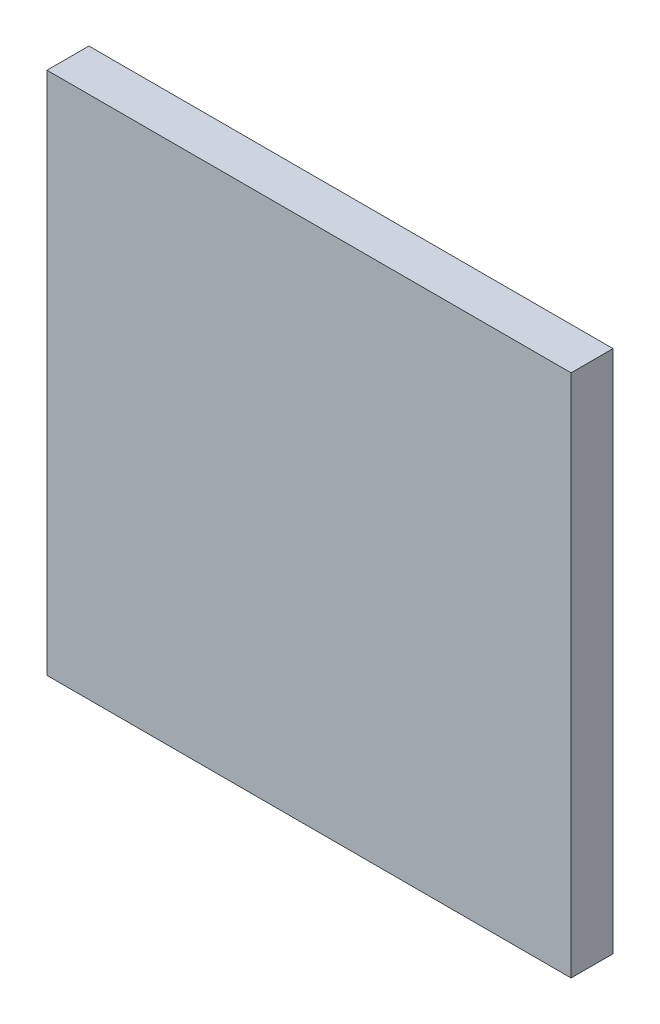
ISO-10303-21;
HEADER;
FILE_DESCRIPTION(('STEP AP214'),'2;1');
FILE_NAME('part.step','',(''),(''),'','','');
FILE_SCHEMA(('AUTOMOTIVE_DESIGN { 1 0 10303 214 1 1 1 1 }'));
ENDSEC;
DATA;
#1=APPLICATION_CONTEXT('core data for automotive mechanical design processes');
#2=APPLICATION_PROTOCOL_DEFINITION('international standard','automotive_design',2000,#1);
#3=PRODUCT_CONTEXT('',#1,'mechanical');
#4=PRODUCT('Part','Part','',(#3));
#5=PRODUCT_RELATED_PRODUCT_CATEGORY('part','',(#4));
#6=PRODUCT_DEFINITION_FORMATION('','',#4);
#7=PRODUCT_DEFINITION_CONTEXT('part definition',#1,'design');
#8=PRODUCT_DEFINITION('design','',#6,#7);
#9=PRODUCT_DEFINITION_SHAPE('','',#8);
#10=(LENGTH_UNIT() NAMED_UNIT(*) SI_UNIT(.MILLI.,.METRE.));
#11=(NAMED_UNIT(*) PLANE_ANGLE_UNIT() SI_UNIT($,.RADIAN.));
#12=(NAMED_UNIT(*) SI_UNIT($,.STERADIAN.) SOLID_ANGLE_UNIT());
#13=UNCERTAINTY_MEASURE_WITH_UNIT(LENGTH_MEASURE(1.E-05),#10,'distance_accuracy_value','');
#14=(GEOMETRIC_REPRESENTATION_CONTEXT(3) GLOBAL_UNCERTAINTY_ASSIGNED_CONTEXT((#13)) GLOBAL_UNIT_ASSIGNED_CONTEXT((#10,
#11,#12)) REPRESENTATION_CONTEXT('',''));
#15=CARTESIAN_POINT('',(0.,0.,0.));
#16=DIRECTION('',(0.,0.,1.));
#17=DIRECTION('',(1.,0.,0.));
#18=AXIS2_PLACEMENT_3D('',#15,#16,#17);
#19=CARTESIAN_POINT('',(-6.9999987,-6.9999987,0.));
#20=DIRECTION('',(0.,0.,1.));
#21=DIRECTION('',(1.,0.,0.));
#22=AXIS2_PLACEMENT_3D('',#19,#20,#21);
#23=PLANE('',#22);
#24=DIRECTION('',(-1.,0.,0.));
#25=VECTOR('',#24,1.);
#26=CARTESIAN_POINT('',(-6.9999987,6.9999987,0.));
#27=LINE('',#26,#25);
#28=CARTESIAN_POINT('',(6.9999987,6.9999987,0.));
#29=VERTEX_POINT('',#28);
#30=CARTESIAN_POINT('',(-6.9999987,6.9999987,0.));
#31=VERTEX_POINT('',#30);
#32=EDGE_CURVE('E62',#29,#31,#27,.T.);
#33=ORIENTED_EDGE('',*,*,#32,.F.);
#34=DIRECTION('',(0.,1.,0.));
#35=VECTOR('',#34,1.);
#36=CARTESIAN_POINT('',(6.9999987,-6.9999987,0.));
#37=LINE('',#36,#35);
#38=CARTESIAN_POINT('',(6.9999987,-6.9999987,0.));
#39=VERTEX_POINT('',#38);
#40=EDGE_CURVE('E56',#39,#29,#37,.T.);
#41=ORIENTED_EDGE('',*,*,#40,.F.);
#42=DIRECTION('',(1.,0.,0.));
#43=VECTOR('',#42,1.);
#44=CARTESIAN_POINT('',(-6.9999987,-6.9999987,0.));
#45=LINE('',#44,#43);
#46=CARTESIAN_POINT('',(-6.9999987,-6.9999987,0.));
#47=VERTEX_POINT('',#46);
#48=EDGE_CURVE('E59',#47,#39,#45,.T.);
#49=ORIENTED_EDGE('',*,*,#48,.F.);
#50=DIRECTION('',(0.,-1.,0.));
#51=VECTOR('',#50,1.);
#52=CARTESIAN_POINT('',(-6.9999987,-6.9999987,0.));
#53=LINE('',#52,#51);
#54=EDGE_CURVE('E11',#31,#47,#53,.T.);
#55=ORIENTED_EDGE('',*,*,#54,.F.);
#56=EDGE_LOOP('',(#33,#41,#49,#55));
#57=FACE_BOUND('',#56,.T.);
#58=ADVANCED_FACE('F17',(#57),#23,.F.);
#59=CARTESIAN_POINT('',(-6.9999987,-6.9999987,0.));
#60=DIRECTION('',(-1.,0.,0.));
#61=DIRECTION('',(0.,0.,1.));
#62=AXIS2_PLACEMENT_3D('',#59,#60,#61);
#63=PLANE('',#62);
#64=DIRECTION('',(0.,0.,-1.));
#65=VECTOR('',#64,1.);
#66=CARTESIAN_POINT('',(-6.9999987,6.9999987,0.));
#67=LINE('',#66,#65);
#68=CARTESIAN_POINT('',(-6.9999987,6.9999987,1.12));
#69=VERTEX_POINT('',#68);
#70=EDGE_CURVE('E27',#69,#31,#67,.T.);
#71=ORIENTED_EDGE('',*,*,#70,.T.);
#72=ORIENTED_EDGE('',*,*,#54,.T.);
#73=DIRECTION('',(0.,0.,1.));
#74=VECTOR('',#73,1.);
#75=CARTESIAN_POINT('',(-6.9999987,-6.9999987,0.));
#76=LINE('',#75,#74);
#77=CARTESIAN_POINT('',(-6.9999987,-6.9999987,1.12));
#78=VERTEX_POINT('',#77);
#79=EDGE_CURVE('E79',#47,#78,#76,.T.);
#80=ORIENTED_EDGE('',*,*,#79,.T.);
#81=DIRECTION('',(0.,1.,0.));
#82=VECTOR('',#81,1.);
#83=CARTESIAN_POINT('',(-6.9999987,-6.9999987,1.12));
#84=LINE('',#83,#82);
#85=EDGE_CURVE('E111',#78,#69,#84,.T.);
#86=ORIENTED_EDGE('',*,*,#85,.T.);
#87=EDGE_LOOP('',(#71,#72,#80,#86));
#88=FACE_BOUND('',#87,.T.);
#89=ADVANCED_FACE('F177',(#88),#63,.T.);
#90=CARTESIAN_POINT('',(-6.9999987,6.9999987,0.));
#91=DIRECTION('',(0.,1.,0.));
#92=DIRECTION('',(1.,0.,0.));
#93=AXIS2_PLACEMENT_3D('',#90,#91,#92);
#94=PLANE('',#93);
#95=DIRECTION('',(0.,0.,-1.));
#96=VECTOR('',#95,1.);
#97=CARTESIAN_POINT('',(6.9999987,6.9999987,0.));
#98=LINE('',#97,#96);
#99=CARTESIAN_POINT('',(6.9999987,6.9999987,1.12));
#100=VERTEX_POINT('',#99);
#101=EDGE_CURVE('E20',#100,#29,#98,.T.);
#102=ORIENTED_EDGE('',*,*,#101,.T.);
#103=ORIENTED_EDGE('',*,*,#32,.T.);
#104=ORIENTED_EDGE('',*,*,#70,.F.);
#105=DIRECTION('',(1.,0.,0.));
#106=VECTOR('',#105,1.);
#107=CARTESIAN_POINT('',(-6.9999987,6.9999987,1.12));
#108=LINE('',#107,#106);
#109=EDGE_CURVE('E105',#69,#100,#108,.T.);
#110=ORIENTED_EDGE('',*,*,#109,.T.);
#111=EDGE_LOOP('',(#102,#103,#104,#110));
#112=FACE_BOUND('',#111,.T.);
#113=ADVANCED_FACE('F103',(#112),#94,.T.);
#114=CARTESIAN_POINT('',(6.9999987,6.9999987,0.));
#115=DIRECTION('',(1.,0.,0.));
#116=DIRECTION('',(0.,1.,0.));
#117=AXIS2_PLACEMENT_3D('',#114,#115,#116);
#118=PLANE('',#117);
#119=DIRECTION('',(0.,0.,-1.));
#120=VECTOR('',#119,1.);
#121=CARTESIAN_POINT('',(6.9999987,-6.9999987,0.));
#122=LINE('',#121,#120);
#123=CARTESIAN_POINT('',(6.9999987,-6.9999987,1.12));
#124=VERTEX_POINT('',#123);
#125=EDGE_CURVE('E67',#124,#39,#122,.T.);
#126=ORIENTED_EDGE('',*,*,#125,.T.);
#127=ORIENTED_EDGE('',*,*,#40,.T.);
#128=ORIENTED_EDGE('',*,*,#101,.F.);
#129=DIRECTION('',(0.,-1.,0.));
#130=VECTOR('',#129,1.);
#131=CARTESIAN_POINT('',(6.9999987,6.9999987,1.12));
#132=LINE('',#131,#130);
#133=EDGE_CURVE('E71',#100,#124,#132,.T.);
#134=ORIENTED_EDGE('',*,*,#133,.T.);
#135=EDGE_LOOP('',(#126,#127,#128,#134));
#136=FACE_BOUND('',#135,.T.);
#137=ADVANCED_FACE('F69',(#136),#118,.T.);
#138=CARTESIAN_POINT('',(6.9999987,-6.9999987,0.));
#139=DIRECTION('',(0.,-1.,0.));
#140=DIRECTION('',(0.,0.,-1.));
#141=AXIS2_PLACEMENT_3D('',#138,#139,#140);
#142=PLANE('',#141);
#143=ORIENTED_EDGE('',*,*,#79,.F.);
#144=ORIENTED_EDGE('',*,*,#48,.T.);
#145=ORIENTED_EDGE('',*,*,#125,.F.);
#146=DIRECTION('',(-1.,0.,0.));
#147=VECTOR('',#146,1.);
#148=CARTESIAN_POINT('',(6.9999987,-6.9999987,1.12));
#149=LINE('',#148,#147);
#150=EDGE_CURVE('E89',#124,#78,#149,.T.);
#151=ORIENTED_EDGE('',*,*,#150,.T.);
#152=EDGE_LOOP('',(#143,#144,#145,#151));
#153=FACE_BOUND('',#152,.T.);
#154=ADVANCED_FACE('F77',(#153),#142,.T.);
#155=CARTESIAN_POINT('',(-6.9999987,-6.9999987,1.12));
#156=DIRECTION('',(0.,0.,1.));
#157=DIRECTION('',(1.,0.,0.));
#158=AXIS2_PLACEMENT_3D('',#155,#156,#157);
#159=PLANE('',#158);
#160=ORIENTED_EDGE('',*,*,#109,.F.);
#161=ORIENTED_EDGE('',*,*,#85,.F.);
#162=ORIENTED_EDGE('',*,*,#150,.F.);
#163=ORIENTED_EDGE('',*,*,#133,.F.);
#164=EDGE_LOOP('',(#160,#161,#162,#163));
#165=FACE_BOUND('',#164,.T.);
#166=ADVANCED_FACE('F108',(#165),#159,.T.);
#167=CLOSED_SHELL('',(#58,#89,#113,#137,#154,#166));
#168=MANIFOLD_SOLID_BREP('B1',#167);
#169=ADVANCED_BREP_SHAPE_REPRESENTATION('',(#18,#168),#14);
#170=SHAPE_DEFINITION_REPRESENTATION(#9,#169);
ENDSEC;
END-ISO-10303-21;
